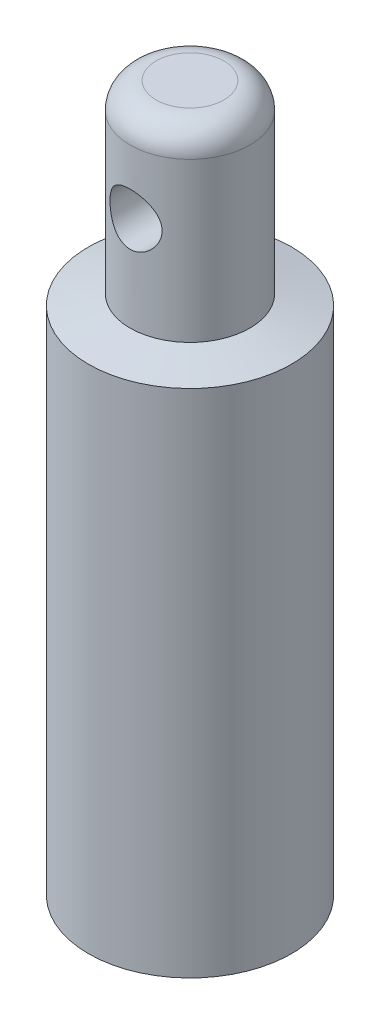
ISO-10303-21;
HEADER;
FILE_DESCRIPTION(('STEP AP214'),'2;1');
FILE_NAME('part.step','',(''),(''),'','','');
FILE_SCHEMA(('AUTOMOTIVE_DESIGN { 1 0 10303 214 1 1 1 1 }'));
ENDSEC;
DATA;
#1=APPLICATION_CONTEXT('core data for automotive mechanical design processes');
#2=APPLICATION_PROTOCOL_DEFINITION('international standard','automotive_design',2000,#1);
#3=PRODUCT_CONTEXT('',#1,'mechanical');
#4=PRODUCT('Part','Part','',(#3));
#5=PRODUCT_RELATED_PRODUCT_CATEGORY('part','',(#4));
#6=PRODUCT_DEFINITION_FORMATION('','',#4);
#7=PRODUCT_DEFINITION_CONTEXT('part definition',#1,'design');
#8=PRODUCT_DEFINITION('design','',#6,#7);
#9=PRODUCT_DEFINITION_SHAPE('','',#8);
#10=(LENGTH_UNIT() NAMED_UNIT(*) SI_UNIT(.MILLI.,.METRE.));
#11=(NAMED_UNIT(*) PLANE_ANGLE_UNIT() SI_UNIT($,.RADIAN.));
#12=(NAMED_UNIT(*) SI_UNIT($,.STERADIAN.) SOLID_ANGLE_UNIT());
#13=UNCERTAINTY_MEASURE_WITH_UNIT(LENGTH_MEASURE(1.E-05),#10,'distance_accuracy_value','');
#14=(GEOMETRIC_REPRESENTATION_CONTEXT(3) GLOBAL_UNCERTAINTY_ASSIGNED_CONTEXT((#13)) GLOBAL_UNIT_ASSIGNED_CONTEXT((#10,
#11,#12)) REPRESENTATION_CONTEXT('',''));
#15=CARTESIAN_POINT('',(0.,0.,0.));
#16=DIRECTION('',(0.,0.,1.));
#17=DIRECTION('',(1.,0.,0.));
#18=AXIS2_PLACEMENT_3D('',#15,#16,#17);
#19=CARTESIAN_POINT('',(0.,25.4,0.));
#20=DIRECTION('',(0.,-1.,0.));
#21=DIRECTION('',(0.,0.,-1.));
#22=AXIS2_PLACEMENT_3D('',#19,#20,#21);
#23=CYLINDRICAL_SURFACE('',#22,4.953);
#24=CARTESIAN_POINT('',(0.,24.892,0.));
#25=DIRECTION('',(0.,1.,0.));
#26=DIRECTION('',(0.,0.,1.));
#27=AXIS2_PLACEMENT_3D('',#24,#25,#26);
#28=CIRCLE('',#27,4.953);
#29=CARTESIAN_POINT('',(0.,24.892,4.953));
#30=VERTEX_POINT('',#29);
#31=EDGE_CURVE('E50',#30,#30,#28,.F.);
#32=ORIENTED_EDGE('',*,*,#31,.T.);
#33=EDGE_LOOP('',(#32));
#34=FACE_BOUND('',#33,.T.);
#35=CARTESIAN_POINT('',(0.,0.,0.));
#36=DIRECTION('',(0.,1.,0.));
#37=DIRECTION('',(0.,0.,1.));
#38=AXIS2_PLACEMENT_3D('',#35,#36,#37);
#39=CIRCLE('',#38,4.953);
#40=CARTESIAN_POINT('',(0.,0.,4.953));
#41=VERTEX_POINT('',#40);
#42=EDGE_CURVE('E47',#41,#41,#39,.T.);
#43=ORIENTED_EDGE('',*,*,#42,.T.);
#44=EDGE_LOOP('',(#43));
#45=FACE_BOUND('',#44,.T.);
#46=ADVANCED_FACE('F16',(#34,#45),#23,.T.);
#47=CARTESIAN_POINT('',(0.,0.,0.));
#48=DIRECTION('',(0.,1.,0.));
#49=DIRECTION('',(0.,0.,1.));
#50=AXIS2_PLACEMENT_3D('',#47,#48,#49);
#51=PLANE('',#50);
#52=CARTESIAN_POINT('',(0.,0.,0.));
#53=DIRECTION('',(0.,-1.,0.));
#54=DIRECTION('',(0.,0.,-1.));
#55=AXIS2_PLACEMENT_3D('',#52,#53,#54);
#56=CIRCLE('',#55,1.25);
#57=CARTESIAN_POINT('',(0.,0.,-1.25));
#58=VERTEX_POINT('',#57);
#59=EDGE_CURVE('E36',#58,#58,#56,.T.);
#60=ORIENTED_EDGE('',*,*,#59,.F.);
#61=EDGE_LOOP('',(#60));
#62=FACE_BOUND('',#61,.T.);
#63=ORIENTED_EDGE('',*,*,#42,.F.);
#64=EDGE_LOOP('',(#63));
#65=FACE_BOUND('',#64,.T.);
#66=ADVANCED_FACE('F81',(#62,#65),#51,.F.);
#67=CARTESIAN_POINT('',(0.,34.4,0.));
#68=DIRECTION('',(0.,-1.,0.));
#69=DIRECTION('',(0.,0.,-1.));
#70=AXIS2_PLACEMENT_3D('',#67,#68,#69);
#71=CYLINDRICAL_SURFACE('',#70,2.921);
#72=CARTESIAN_POINT('',(0.,33.13,0.));
#73=DIRECTION('',(0.,1.,0.));
#74=DIRECTION('',(0.,0.,1.));
#75=AXIS2_PLACEMENT_3D('',#72,#73,#74);
#76=CIRCLE('',#75,2.921);
#77=CARTESIAN_POINT('',(0.,33.13,2.921));
#78=VERTEX_POINT('',#77);
#79=EDGE_CURVE('E11',#78,#78,#76,.F.);
#80=ORIENTED_EDGE('',*,*,#79,.T.);
#81=EDGE_LOOP('',(#80));
#82=FACE_BOUND('',#81,.T.);
#83=CARTESIAN_POINT('',(0.,31.27,-2.921));
#84=CARTESIAN_POINT('',(-0.0677737236435002,31.2699920368808,-2.92099391613703));
#85=CARTESIAN_POINT('',(-0.135640273851537,31.2645431877353,-2.91861443581103));
#86=CARTESIAN_POINT('',(-0.26943825950259,31.2429478839318,-2.90932478001171));
#87=CARTESIAN_POINT('',(-0.335364475242355,31.2267749176374,-2.90240337665979));
#88=CARTESIAN_POINT('',(-0.463122549755001,31.1844526824103,-2.88477059064785));
#89=CARTESIAN_POINT('',(-0.524967883170802,31.1583383953522,-2.87407250698911));
#90=CARTESIAN_POINT('',(-0.643335260592914,31.0970258240721,-2.84991489355874));
#91=CARTESIAN_POINT('',(-0.699858652458068,31.0618298484117,-2.83645606574519));
#92=CARTESIAN_POINT('',(-0.809106079189141,30.9813627488992,-2.80730126907565));
#93=CARTESIAN_POINT('',(-0.861507456556212,30.9356818980142,-2.79152791875551));
#94=CARTESIAN_POINT('',(-0.958187415023221,30.8364102492315,-2.75983899220508));
#95=CARTESIAN_POINT('',(-1.00246135931243,30.7828149673091,-2.74392334018582));
#96=CARTESIAN_POINT('',(-1.08402933573631,30.6656914056653,-2.71277220575457));
#97=CARTESIAN_POINT('',(-1.12080948061217,30.6017802856561,-2.69762147073104));
#98=CARTESIAN_POINT('',(-1.18295355045665,30.4679280413673,-2.67095747415499));
#99=CARTESIAN_POINT('',(-1.2083238663237,30.397990318948,-2.65944217739278));
#100=CARTESIAN_POINT('',(-1.24556611777148,30.2577829848269,-2.64219800019961));
#101=CARTESIAN_POINT('',(-1.25806169026896,30.1877130349378,-2.63620345333815));
#102=CARTESIAN_POINT('',(-1.27114145729395,30.0462344957599,-2.62992372240774));
#103=CARTESIAN_POINT('',(-1.27173309332521,29.9748267707044,-2.62963497147855));
#104=CARTESIAN_POINT('',(-1.26145488554734,29.8391790348342,-2.63457668774346));
#105=CARTESIAN_POINT('',(-1.25155363533284,29.7748450960427,-2.63934076130016));
#106=CARTESIAN_POINT('',(-1.22220630768514,29.64886353229,-2.65305715974671));
#107=CARTESIAN_POINT('',(-1.20275820305549,29.5872164808958,-2.66201037414743));
#108=CARTESIAN_POINT('',(-1.15448471150469,29.4667349145029,-2.68330252269374));
#109=CARTESIAN_POINT('',(-1.12546170454899,29.4079925880817,-2.69571186654326));
#110=CARTESIAN_POINT('',(-1.05900344101624,29.2959703634957,-2.72250518577643));
#111=CARTESIAN_POINT('',(-1.02156471431622,29.2426927318683,-2.73688997475696));
#112=CARTESIAN_POINT('',(-0.935264801181973,29.1379079277594,-2.76763525659614));
#113=CARTESIAN_POINT('',(-0.885666035484244,29.0870238497175,-2.78405521661951));
#114=CARTESIAN_POINT('',(-0.778492022921058,28.9940759555942,-2.81590388646384));
#115=CARTESIAN_POINT('',(-0.72091457202261,28.9520145847968,-2.83133232065583));
#116=CARTESIAN_POINT('',(-0.597380249255692,28.8768791745976,-2.85998258163675));
#117=CARTESIAN_POINT('',(-0.531238283606285,28.8440802188788,-2.87313310660294));
#118=CARTESIAN_POINT('',(-0.393656994640506,28.7902975090797,-2.89518837721773));
#119=CARTESIAN_POINT('',(-0.322220894865513,28.7693066310042,-2.90409568236825));
#120=CARTESIAN_POINT('',(-0.181267380774802,28.741090053638,-2.91616957801645));
#121=CARTESIAN_POINT('',(-0.111946892501511,28.7330294927389,-2.91968364401783));
#122=CARTESIAN_POINT('',(0.0271406391837621,28.7283866693925,-2.92170077262574));
#123=CARTESIAN_POINT('',(0.0969075323442661,28.7318007287461,-2.92020544099929));
#124=CARTESIAN_POINT('',(0.230854142134029,28.7494324310319,-2.91259403990684));
#125=CARTESIAN_POINT('',(0.295129981482348,28.7630448697419,-2.90673692530121));
#126=CARTESIAN_POINT('',(0.420403425664735,28.7998232208763,-2.89127790257705));
#127=CARTESIAN_POINT('',(0.481400625109391,28.8229903116342,-2.88167553258052));
#128=CARTESIAN_POINT('',(0.600545371704893,28.8789676824437,-2.85926171807263));
#129=CARTESIAN_POINT('',(0.65854429669711,28.9120566916739,-2.84635936614312));
#130=CARTESIAN_POINT('',(0.768375750125299,28.9866343868498,-2.81869696054021));
#131=CARTESIAN_POINT('',(0.820205606747199,29.0281266913846,-2.80393610760697));
#132=CARTESIAN_POINT('',(0.92045394615788,29.1220813189359,-2.77271913671627));
#133=CARTESIAN_POINT('',(0.968297627307216,29.1751442547284,-2.75622024744379));
#134=CARTESIAN_POINT('',(1.05458293131355,29.2887716830081,-2.72437445138018));
#135=CARTESIAN_POINT('',(1.09302166936341,29.3493384686144,-2.70902789904686));
#136=CARTESIAN_POINT('',(1.16004197785896,29.4779270707972,-2.6810248778143));
#137=CARTESIAN_POINT('',(1.18841067294643,29.5460739186524,-2.66842845258061));
#138=CARTESIAN_POINT('',(1.23300923183583,29.6869021802374,-2.64812020456358));
#139=CARTESIAN_POINT('',(1.2492503118952,29.7595793365152,-2.64040386942939));
#140=CARTESIAN_POINT('',(1.26797290729401,29.9009737457833,-2.63146033599271));
#141=CARTESIAN_POINT('',(1.27147526850857,29.9695257603354,-2.62975208145452));
#142=CARTESIAN_POINT('',(1.26739528437239,30.1062127153669,-2.63172112625301));
#143=CARTESIAN_POINT('',(1.25981504333527,30.1743477325574,-2.63539740319982));
#144=CARTESIAN_POINT('',(1.23466667447704,30.3043739065708,-2.647265415944));
#145=CARTESIAN_POINT('',(1.21767236774951,30.3664021858948,-2.6551969728654));
#146=CARTESIAN_POINT('',(1.1747677160964,30.4867276088829,-2.67445540270426));
#147=CARTESIAN_POINT('',(1.14885482017654,30.5450236793547,-2.68578324694606));
#148=CARTESIAN_POINT('',(1.08698094167732,30.6602374672003,-2.71143882971638));
#149=CARTESIAN_POINT('',(1.05049084166704,30.7168383370508,-2.72591035462177));
#150=CARTESIAN_POINT('',(0.969204347043789,30.8234315572599,-2.75585900786656));
#151=CARTESIAN_POINT('',(0.92440468037057,30.8734212910204,-2.77133653077311));
#152=CARTESIAN_POINT('',(0.823410694486416,30.96961191405,-2.80308022759713));
#153=CARTESIAN_POINT('',(0.766582450315806,31.0151636213363,-2.81930665440505));
#154=CARTESIAN_POINT('',(0.645507119039801,31.0961400151557,-2.84946455683428));
#155=CARTESIAN_POINT('',(0.58125668368911,31.1315601059447,-2.86339498977276));
#156=CARTESIAN_POINT('',(0.447897614243237,31.1906031837006,-2.88724029978316));
#157=CARTESIAN_POINT('',(0.378865540352488,31.2143777657462,-2.89720644162254));
#158=CARTESIAN_POINT('',(0.237371220359486,31.2497351415549,-2.91220114216086));
#159=CARTESIAN_POINT('',(0.164920266021513,31.2613554852547,-2.9172449050619));
#160=CARTESIAN_POINT('',(0.0614162789267146,31.2688895226732,-2.92051795917323));
#161=CARTESIAN_POINT('',(0.0307176739263883,31.2700036091937,-2.9210027574421));
#162=CARTESIAN_POINT('',(0.,31.27,-2.921));
#163=B_SPLINE_CURVE_WITH_KNOTS('',3,(#83,#84,#85,#86,#87,#88,#89,#90,#91,#92,#93,#94,#95,#96,
#97,#98,#99,#100,#101,#102,#103,#104,#105,#106,#107,#108,#109,#110,#111,#112,#113,#114,#115,
#116,#117,#118,#119,#120,#121,#122,#123,#124,#125,#126,#127,#128,#129,#130,#131,#132,#133,#134,
#135,#136,#137,#138,#139,#140,#141,#142,#143,#144,#145,#146,#147,#148,#149,#150,#151,#152,#153,
#154,#155,#156,#157,#158,#159,#160,#161,#162),.UNSPECIFIED.,.T.,.F.,(4,2,2,2,2,2,2,2,2,2,2,2,2,
2,2,2,2,2,2,2,2,2,2,2,2,2,2,2,2,2,2,2,2,2,2,2,2,2,2,4),(0.,0.203228194554583,0.406960682381836,
0.609982798287558,0.812953356806022,1.02588633758951,1.23894042451939,1.46364162149316,
1.68821680110619,1.90131378154953,2.1142775446086,2.30916483670153,2.50409352942948,
2.7033274171726,2.90264360785226,3.12045595451829,3.33832859008475,3.56211788364285,
3.78577201647072,3.99430183271106,4.20276481092381,4.39974965279553,4.59675879521204,
4.79992456047392,5.00317799879033,5.22216789338686,5.44122487545487,5.66466985016148,
5.88790791435661,6.09280490743359,6.297663000663,6.49122442555593,6.68484126111957,
6.89062561178804,7.0964911669065,7.31927829341663,7.5421663174298,7.76207023237835,
7.98129273974664,8.0734036210347),.UNSPECIFIED.);
#164=CARTESIAN_POINT('',(0.,31.27,-2.921));
#165=VERTEX_POINT('',#164);
#166=EDGE_CURVE('E39',#165,#165,#163,.T.);
#167=ORIENTED_EDGE('',*,*,#166,.T.);
#168=EDGE_LOOP('',(#167));
#169=FACE_BOUND('',#168,.T.);
#170=CARTESIAN_POINT('',(1.27,30.,2.63046402750541));
#171=CARTESIAN_POINT('',(1.26999163598308,29.9325694729038,2.63047239889149));
#172=CARTESIAN_POINT('',(1.26459569642466,29.8650420033878,2.63309492304428));
#173=CARTESIAN_POINT('',(1.2432297187067,29.7319545310762,2.64324619868234));
#174=CARTESIAN_POINT('',(1.22723217610882,29.6664001107911,2.65078771101883));
#175=CARTESIAN_POINT('',(1.18542171448293,29.5394328427284,2.66974471061985));
#176=CARTESIAN_POINT('',(1.15965122632882,29.4780034238305,2.68114342846301));
#177=CARTESIAN_POINT('',(1.09915173667445,29.3603558516272,2.70650663283625));
#178=CARTESIAN_POINT('',(1.06442430246458,29.3041367889485,2.72047067036267));
#179=CARTESIAN_POINT('',(0.984477479710495,29.1946577663232,2.75044987061199));
#180=CARTESIAN_POINT('',(0.938743520622543,29.1417934797231,2.76653839747676));
#181=CARTESIAN_POINT('',(0.839160308150103,29.0441894373147,2.79835351293316));
#182=CARTESIAN_POINT('',(0.785307775735254,28.9994529804483,2.81407995230841));
#183=CARTESIAN_POINT('',(0.667847023238182,28.9172918603283,2.84430432537697));
#184=CARTESIAN_POINT('',(0.603894748156163,28.8803208773174,2.85870714168961));
#185=CARTESIAN_POINT('',(0.469937958181279,28.817835660247,2.88375289995025));
#186=CARTESIAN_POINT('',(0.399936376133722,28.7923159111142,2.89439765130668));
#187=CARTESIAN_POINT('',(0.260030469870858,28.7549180546129,2.91020606042171));
#188=CARTESIAN_POINT('',(0.190340738292025,28.742355329783,2.91564356203674));
#189=CARTESIAN_POINT('',(0.0496448449966125,28.7290073050494,2.92142513098548));
#190=CARTESIAN_POINT('',(-0.021360718102677,28.7282167751678,2.92177146014958));
#191=CARTESIAN_POINT('',(-0.157661367926691,28.738095734668,2.91748668507765));
#192=CARTESIAN_POINT('',(-0.2230234645939,28.7480105095125,2.91318336318469));
#193=CARTESIAN_POINT('',(-0.351048120923454,28.7777134721529,2.90054227665558));
#194=CARTESIAN_POINT('',(-0.413710480524896,28.7975023902984,2.89220421358767));
#195=CARTESIAN_POINT('',(-0.535717567226873,28.8466140292229,2.87213021278812));
#196=CARTESIAN_POINT('',(-0.594996884712366,28.8760779527403,2.86034425071427));
#197=CARTESIAN_POINT('',(-0.707925919581857,28.943556901507,2.83450923026923));
#198=CARTESIAN_POINT('',(-0.761573590605607,28.9815750194117,2.82045935393266));
#199=CARTESIAN_POINT('',(-0.866039880204416,29.0684252586283,2.79023171096569));
#200=CARTESIAN_POINT('',(-0.916336112677082,29.1178585064318,2.77397337573678));
#201=CARTESIAN_POINT('',(-1.00816301956826,29.2244614603965,2.74193698404883));
#202=CARTESIAN_POINT('',(-1.0496896894526,29.2816346814687,2.72615914980798));
#203=CARTESIAN_POINT('',(-1.12431260877268,29.4048505175433,2.69626471936643));
#204=CARTESIAN_POINT('',(-1.1570233852472,29.4711496088336,2.68223530648741));
#205=CARTESIAN_POINT('',(-1.21059826693207,29.6090853518787,2.65848858731721));
#206=CARTESIAN_POINT('',(-1.23147171260255,29.6807177446584,2.64876788248847));
#207=CARTESIAN_POINT('',(-1.25938664843939,29.8220389212515,2.63560431170318));
#208=CARTESIAN_POINT('',(-1.26728063457455,29.8915226026701,2.63177569578012));
#209=CARTESIAN_POINT('',(-1.27153477501034,30.0309124581014,2.62972412020424));
#210=CARTESIAN_POINT('',(-1.26789954963127,30.1008184516657,2.63149891498875));
#211=CARTESIAN_POINT('',(-1.24997804635492,30.2337212842238,2.64005287025195));
#212=CARTESIAN_POINT('',(-1.23648220412201,30.296851845252,2.64646029652486));
#213=CARTESIAN_POINT('',(-1.20029510118779,30.4198882509009,2.6630670239854));
#214=CARTESIAN_POINT('',(-1.17760156000003,30.4797932916071,2.67326726551551));
#215=CARTESIAN_POINT('',(-1.12256395957313,30.5976326074413,2.69685413739278));
#216=CARTESIAN_POINT('',(-1.08983913932592,30.6553641237243,2.71036124298351));
#217=CARTESIAN_POINT('',(-1.0160356280653,30.764808917687,2.73888232494473));
#218=CARTESIAN_POINT('',(-0.974953108947608,30.8165194204149,2.75389699022594));
#219=CARTESIAN_POINT('',(-0.881243757871096,30.917311035833,2.78537323131986));
#220=CARTESIAN_POINT('',(-0.827910182847515,30.9657351401546,2.80184325148622));
#221=CARTESIAN_POINT('',(-0.713509797715736,31.0530824453147,2.83313575850639));
#222=CARTESIAN_POINT('',(-0.652442095479702,31.0920045485832,2.8479580549251));
#223=CARTESIAN_POINT('',(-0.523593571557241,31.1593373335187,2.87444565375739));
#224=CARTESIAN_POINT('',(-0.455773088889865,31.1876806330421,2.88609059570779));
#225=CARTESIAN_POINT('',(-0.315685151763295,31.2323301508024,2.90474839373037));
#226=CARTESIAN_POINT('',(-0.243420638961197,31.2486442406221,2.91176427861302));
#227=CARTESIAN_POINT('',(-0.10234034614782,31.2677181353782,2.91999727409116));
#228=CARTESIAN_POINT('',(-0.033671801454977,31.2714018460193,2.92160944427872));
#229=CARTESIAN_POINT('',(0.103293261217027,31.2676438119784,2.91997568767021));
#230=CARTESIAN_POINT('',(0.171589852303702,31.2602043390571,2.91673075287233));
#231=CARTESIAN_POINT('',(0.302960932072505,31.2350730188586,2.90596386332924));
#232=CARTESIAN_POINT('',(0.366134667639694,31.2178155032879,2.89862333955234));
#233=CARTESIAN_POINT('',(0.488650993512215,31.1740334623399,2.88050336566847));
#234=CARTESIAN_POINT('',(0.547992888986685,31.1475072618236,2.86972329395911));
#235=CARTESIAN_POINT('',(0.66416198517554,31.0845969907947,2.84513906640802));
#236=CARTESIAN_POINT('',(0.720749866625994,31.0478173822958,2.8312191052357));
#237=CARTESIAN_POINT('',(0.827197641668616,30.9659995196721,2.8019702681258));
#238=CARTESIAN_POINT('',(0.877054781576818,30.9209579030593,2.78664081982392));
#239=CARTESIAN_POINT('',(0.972528518196216,30.8199231284514,2.75484083782566));
#240=CARTESIAN_POINT('',(1.01754622281382,30.7633618190569,2.73837099090877));
#241=CARTESIAN_POINT('',(1.09756614752785,30.6430163873369,2.70729367850033));
#242=CARTESIAN_POINT('',(1.13256238863555,30.5792279847344,2.69268732767382));
#243=CARTESIAN_POINT('',(1.19136093844958,30.4459453523013,2.66719554163211));
#244=CARTESIAN_POINT('',(1.2151600676734,30.3764495083827,2.65631116353124));
#245=CARTESIAN_POINT('',(1.25041012436242,30.2339305654217,2.63990706424809));
#246=CARTESIAN_POINT('',(1.2619024767072,30.1609201692823,2.63436935230456));
#247=CARTESIAN_POINT('',(1.26899718891061,30.0583750134529,2.63094687530717));
#248=CARTESIAN_POINT('',(1.27000362151709,30.029196594032,2.63046040279757));
#249=CARTESIAN_POINT('',(1.27,30.,2.63046402750541));
#250=B_SPLINE_CURVE_WITH_KNOTS('',3,(#170,#171,#172,#173,#174,#175,#176,#177,#178,#179,#180,
#181,#182,#183,#184,#185,#186,#187,#188,#189,#190,#191,#192,#193,#194,#195,#196,#197,#198,#199,
#200,#201,#202,#203,#204,#205,#206,#207,#208,#209,#210,#211,#212,#213,#214,#215,#216,#217,#218,
#219,#220,#221,#222,#223,#224,#225,#226,#227,#228,#229,#230,#231,#232,#233,#234,#235,#236,#237,
#238,#239,#240,#241,#242,#243,#244,#245,#246,#247,#248,#249),.UNSPECIFIED.,.T.,.F.,(4,2,2,2,2,2,
2,2,2,2,2,2,2,2,2,2,2,2,2,2,2,2,2,2,2,2,2,2,2,2,2,2,2,2,2,2,2,2,2,4),(0.,0.202202176996419,
0.404931004929713,0.606789545898596,0.80861278950525,1.02286969259801,1.23721336543146,
1.46183891042883,1.68635615622488,1.89828553771513,2.11012076352425,2.30794134525048,
2.50577656111726,2.70663794552907,2.90757206572769,3.12373156074921,3.33998955044626,
3.56456136050968,3.78895572067588,3.99791869678222,4.20679794176206,4.40054976063971,
4.59434964794866,4.79667857655085,4.99910038803743,5.21976572317635,5.44045653517746,
5.66252998285725,5.88445798252004,6.08975934076488,6.29501877469669,6.491834634292,
6.68868608303268,6.89454511296148,7.10048811043314,7.32188394781599,7.54341160011162,
7.7650021185136,7.98584439099717,8.07339546212755),.UNSPECIFIED.);
#251=CARTESIAN_POINT('',(1.27,30.,2.63046402750541));
#252=VERTEX_POINT('',#251);
#253=EDGE_CURVE('E35',#252,#252,#250,.T.);
#254=ORIENTED_EDGE('',*,*,#253,.T.);
#255=EDGE_LOOP('',(#254));
#256=FACE_BOUND('',#255,.T.);
#257=CARTESIAN_POINT('',(0.,25.4,0.));
#258=DIRECTION('',(0.,1.,0.));
#259=DIRECTION('',(0.,0.,1.));
#260=AXIS2_PLACEMENT_3D('',#257,#258,#259);
#261=CIRCLE('',#260,2.921);
#262=CARTESIAN_POINT('',(0.,25.4,2.921));
#263=VERTEX_POINT('',#262);
#264=EDGE_CURVE('E44',#263,#263,#261,.T.);
#265=ORIENTED_EDGE('',*,*,#264,.T.);
#266=EDGE_LOOP('',(#265));
#267=FACE_BOUND('',#266,.T.);
#268=ADVANCED_FACE('F61',(#82,#169,#256,#267),#71,.T.);
#269=CARTESIAN_POINT('',(0.,34.4,0.));
#270=DIRECTION('',(0.,1.,0.));
#271=DIRECTION('',(0.,0.,1.));
#272=AXIS2_PLACEMENT_3D('',#269,#270,#271);
#273=PLANE('',#272);
#274=CARTESIAN_POINT('',(0.,34.4,0.));
#275=DIRECTION('',(0.,1.,0.));
#276=DIRECTION('',(0.,0.,1.));
#277=AXIS2_PLACEMENT_3D('',#274,#275,#276);
#278=CIRCLE('',#277,1.651);
#279=CARTESIAN_POINT('',(0.,34.4,1.651));
#280=VERTEX_POINT('',#279);
#281=EDGE_CURVE('E23',#280,#280,#278,.T.);
#282=ORIENTED_EDGE('',*,*,#281,.T.);
#283=EDGE_LOOP('',(#282));
#284=FACE_BOUND('',#283,.T.);
#285=ADVANCED_FACE('F71',(#284),#273,.T.);
#286=CARTESIAN_POINT('',(0.,25.4,0.));
#287=DIRECTION('',(0.,-1.,0.));
#288=DIRECTION('',(0.,0.,-1.));
#289=AXIS2_PLACEMENT_3D('',#286,#287,#288);
#290=CONICAL_SURFACE('',#289,2.921,1.32581766366803);
#291=ORIENTED_EDGE('',*,*,#31,.F.);
#292=EDGE_LOOP('',(#291));
#293=FACE_BOUND('',#292,.T.);
#294=ORIENTED_EDGE('',*,*,#264,.F.);
#295=EDGE_LOOP('',(#294));
#296=FACE_BOUND('',#295,.T.);
#297=ADVANCED_FACE('F68',(#293,#296),#290,.T.);
#298=CARTESIAN_POINT('',(0.,30.,-4.953));
#299=DIRECTION('',(0.,0.,1.));
#300=DIRECTION('',(1.,0.,0.));
#301=AXIS2_PLACEMENT_3D('',#298,#299,#300);
#302=CYLINDRICAL_SURFACE('',#301,1.27);
#303=ORIENTED_EDGE('',*,*,#253,.F.);
#304=EDGE_LOOP('',(#303));
#305=FACE_BOUND('',#304,.T.);
#306=ORIENTED_EDGE('',*,*,#166,.F.);
#307=EDGE_LOOP('',(#306));
#308=FACE_BOUND('',#307,.T.);
#309=ADVANCED_FACE('F65',(#305,#308),#302,.F.);
#310=CARTESIAN_POINT('',(0.,33.13,0.));
#311=DIRECTION('',(0.,1.,0.));
#312=DIRECTION('',(0.,0.,1.));
#313=AXIS2_PLACEMENT_3D('',#310,#311,#312);
#314=TOROIDAL_SURFACE('',#313,1.651,1.27);
#315=ORIENTED_EDGE('',*,*,#79,.F.);
#316=EDGE_LOOP('',(#315));
#317=FACE_BOUND('',#316,.T.);
#318=ORIENTED_EDGE('',*,*,#281,.F.);
#319=EDGE_LOOP('',(#318));
#320=FACE_BOUND('',#319,.T.);
#321=ADVANCED_FACE('F18',(#317,#320),#314,.T.);
#322=CARTESIAN_POINT('',(0.,9.144,0.));
#323=DIRECTION('',(0.,-1.,0.));
#324=DIRECTION('',(0.,0.,-1.));
#325=AXIS2_PLACEMENT_3D('',#322,#323,#324);
#326=CONICAL_SURFACE('',#325,1.25,1.02974425867665);
#327=CARTESIAN_POINT('',(0.,9.89507577378445,0.));
#328=VERTEX_POINT('',#327);
#329=VERTEX_LOOP('',#328);
#330=FACE_BOUND('',#329,.T.);
#331=CARTESIAN_POINT('',(0.,9.144,0.));
#332=DIRECTION('',(0.,-1.,0.));
#333=DIRECTION('',(0.,0.,-1.));
#334=AXIS2_PLACEMENT_3D('',#331,#332,#333);
#335=CIRCLE('',#334,1.25);
#336=CARTESIAN_POINT('',(0.,9.144,-1.25));
#337=VERTEX_POINT('',#336);
#338=EDGE_CURVE('E33',#337,#337,#335,.T.);
#339=ORIENTED_EDGE('',*,*,#338,.T.);
#340=EDGE_LOOP('',(#339));
#341=FACE_BOUND('',#340,.T.);
#342=ADVANCED_FACE('F26',(#330,#341),#326,.F.);
#343=CARTESIAN_POINT('',(0.,0.,0.));
#344=DIRECTION('',(0.,-1.,0.));
#345=DIRECTION('',(0.,0.,-1.));
#346=AXIS2_PLACEMENT_3D('',#343,#344,#345);
#347=CYLINDRICAL_SURFACE('',#346,1.25);
#348=ORIENTED_EDGE('',*,*,#338,.F.);
#349=EDGE_LOOP('',(#348));
#350=FACE_BOUND('',#349,.T.);
#351=ORIENTED_EDGE('',*,*,#59,.T.);
#352=EDGE_LOOP('',(#351));
#353=FACE_BOUND('',#352,.T.);
#354=ADVANCED_FACE('F29',(#350,#353),#347,.F.);
#355=CLOSED_SHELL('',(#46,#66,#268,#285,#297,#309,#321,#342,#354));
#356=MANIFOLD_SOLID_BREP('B1',#355);
#357=ADVANCED_BREP_SHAPE_REPRESENTATION('',(#18,#356),#14);
#358=SHAPE_DEFINITION_REPRESENTATION(#9,#357);
ENDSEC;
END-ISO-10303-21;
